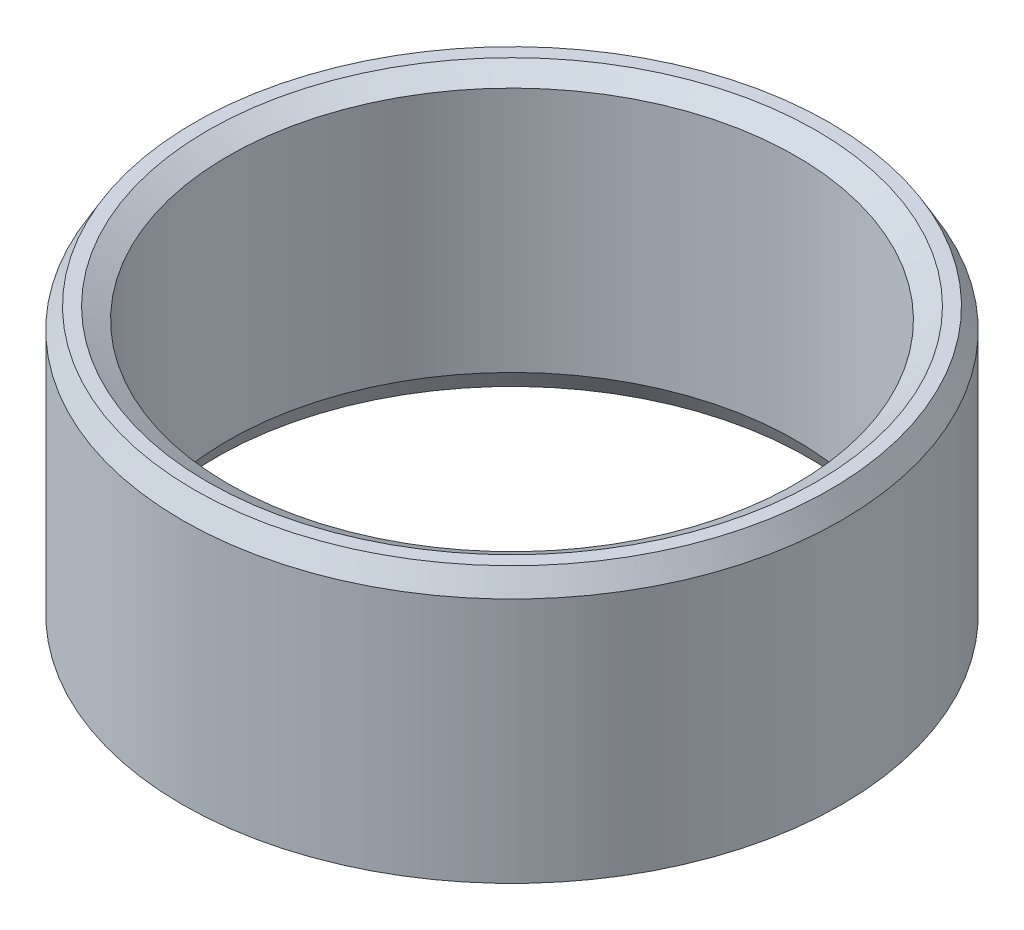
ISO-10303-21;
HEADER;
FILE_DESCRIPTION(('STEP AP214'),'2;1');
FILE_NAME('part.step','',(''),(''),'','','');
FILE_SCHEMA(('AUTOMOTIVE_DESIGN { 1 0 10303 214 1 1 1 1 }'));
ENDSEC;
DATA;
#1=APPLICATION_CONTEXT('core data for automotive mechanical design processes');
#2=APPLICATION_PROTOCOL_DEFINITION('international standard','automotive_design',2000,#1);
#3=PRODUCT_CONTEXT('',#1,'mechanical');
#4=PRODUCT('Part','Part','',(#3));
#5=PRODUCT_RELATED_PRODUCT_CATEGORY('part','',(#4));
#6=PRODUCT_DEFINITION_FORMATION('','',#4);
#7=PRODUCT_DEFINITION_CONTEXT('part definition',#1,'design');
#8=PRODUCT_DEFINITION('design','',#6,#7);
#9=PRODUCT_DEFINITION_SHAPE('','',#8);
#10=(LENGTH_UNIT() NAMED_UNIT(*) SI_UNIT(.MILLI.,.METRE.));
#11=(NAMED_UNIT(*) PLANE_ANGLE_UNIT() SI_UNIT($,.RADIAN.));
#12=(NAMED_UNIT(*) SI_UNIT($,.STERADIAN.) SOLID_ANGLE_UNIT());
#13=UNCERTAINTY_MEASURE_WITH_UNIT(LENGTH_MEASURE(1.E-05),#10,'distance_accuracy_value','');
#14=(GEOMETRIC_REPRESENTATION_CONTEXT(3) GLOBAL_UNCERTAINTY_ASSIGNED_CONTEXT((#13)) GLOBAL_UNIT_ASSIGNED_CONTEXT((#10,
#11,#12)) REPRESENTATION_CONTEXT('',''));
#15=CARTESIAN_POINT('',(0.,0.,0.));
#16=DIRECTION('',(0.,0.,1.));
#17=DIRECTION('',(1.,0.,0.));
#18=AXIS2_PLACEMENT_3D('',#15,#16,#17);
#19=CARTESIAN_POINT('',(0.,46.4747391328106,0.));
#20=DIRECTION('',(0.,-1.,0.));
#21=DIRECTION('',(0.,0.,-1.));
#22=AXIS2_PLACEMENT_3D('',#19,#20,#21);
#23=CYLINDRICAL_SURFACE('',#22,55.);
#24=CARTESIAN_POINT('',(0.,1.97463969113813,0.));
#25=DIRECTION('',(0.,1.,0.));
#26=DIRECTION('',(0.,0.,1.));
#27=AXIS2_PLACEMENT_3D('',#24,#25,#26);
#28=CIRCLE('',#27,55.);
#29=CARTESIAN_POINT('',(0.,1.97463969113813,55.));
#30=VERTEX_POINT('',#29);
#31=EDGE_CURVE('E10',#30,#30,#28,.T.);
#32=ORIENTED_EDGE('',*,*,#31,.T.);
#33=EDGE_LOOP('',(#32));
#34=FACE_BOUND('',#33,.T.);
#35=CARTESIAN_POINT('',(0.,43.0545628611172,0.));
#36=DIRECTION('',(0.,1.,0.));
#37=DIRECTION('',(0.,0.,1.));
#38=AXIS2_PLACEMENT_3D('',#35,#36,#37);
#39=CIRCLE('',#38,55.);
#40=CARTESIAN_POINT('',(0.,43.0545628611172,55.));
#41=VERTEX_POINT('',#40);
#42=EDGE_CURVE('E50',#41,#41,#39,.F.);
#43=ORIENTED_EDGE('',*,*,#42,.T.);
#44=EDGE_LOOP('',(#43));
#45=FACE_BOUND('',#44,.T.);
#46=ADVANCED_FACE('F39',(#34,#45),#23,.T.);
#47=CARTESIAN_POINT('',(0.,46.4747391328106,0.));
#48=DIRECTION('',(0.,1.,0.));
#49=DIRECTION('',(0.,0.,1.));
#50=AXIS2_PLACEMENT_3D('',#47,#48,#49);
#51=PLANE('',#50);
#52=CARTESIAN_POINT('',(0.,46.4747391328106,0.));
#53=DIRECTION('',(0.,1.,0.));
#54=DIRECTION('',(0.,0.,1.));
#55=AXIS2_PLACEMENT_3D('',#52,#53,#54);
#56=CIRCLE('',#55,50.7773806204614);
#57=CARTESIAN_POINT('',(0.,46.4747391328106,50.7773806204614));
#58=VERTEX_POINT('',#57);
#59=EDGE_CURVE('E58',#58,#58,#56,.F.);
#60=ORIENTED_EDGE('',*,*,#59,.T.);
#61=EDGE_LOOP('',(#60));
#62=FACE_BOUND('',#61,.T.);
#63=CARTESIAN_POINT('',(0.,46.4747391328106,0.));
#64=DIRECTION('',(0.,1.,0.));
#65=DIRECTION('',(0.,0.,1.));
#66=AXIS2_PLACEMENT_3D('',#63,#64,#65);
#67=CIRCLE('',#66,53.0253603088618);
#68=CARTESIAN_POINT('',(0.,46.4747391328106,53.0253603088618));
#69=VERTEX_POINT('',#68);
#70=EDGE_CURVE('E61',#69,#69,#67,.T.);
#71=ORIENTED_EDGE('',*,*,#70,.T.);
#72=EDGE_LOOP('',(#71));
#73=FACE_BOUND('',#72,.T.);
#74=ADVANCED_FACE('F88',(#62,#73),#51,.T.);
#75=CARTESIAN_POINT('',(0.,0.,0.));
#76=DIRECTION('',(0.,1.,0.));
#77=DIRECTION('',(0.,0.,1.));
#78=AXIS2_PLACEMENT_3D('',#75,#76,#77);
#79=PLANE('',#78);
#80=CARTESIAN_POINT('',(0.,0.,0.));
#81=DIRECTION('',(0.,1.,0.));
#82=DIRECTION('',(0.,0.,1.));
#83=AXIS2_PLACEMENT_3D('',#80,#81,#82);
#84=CIRCLE('',#83,49.331844039906);
#85=CARTESIAN_POINT('',(0.,0.,49.331844039906));
#86=VERTEX_POINT('',#85);
#87=EDGE_CURVE('E51',#86,#86,#84,.T.);
#88=ORIENTED_EDGE('',*,*,#87,.T.);
#89=EDGE_LOOP('',(#88));
#90=FACE_BOUND('',#89,.T.);
#91=CARTESIAN_POINT('',(0.,0.,0.));
#92=DIRECTION('',(0.,1.,0.));
#93=DIRECTION('',(0.,0.,1.));
#94=AXIS2_PLACEMENT_3D('',#91,#92,#93);
#95=CIRCLE('',#94,51.5798237283066);
#96=CARTESIAN_POINT('',(0.,0.,51.5798237283066));
#97=VERTEX_POINT('',#96);
#98=EDGE_CURVE('E54',#97,#97,#95,.F.);
#99=ORIENTED_EDGE('',*,*,#98,.T.);
#100=EDGE_LOOP('',(#99));
#101=FACE_BOUND('',#100,.T.);
#102=ADVANCED_FACE('F83',(#90,#101),#79,.F.);
#103=CARTESIAN_POINT('',(0.,46.4747391328106,0.));
#104=DIRECTION('',(0.,-1.,0.));
#105=DIRECTION('',(0.,0.,-1.));
#106=AXIS2_PLACEMENT_3D('',#103,#104,#105);
#107=CYLINDRICAL_SURFACE('',#106,47.3572043487679);
#108=CARTESIAN_POINT('',(0.,44.5000994416725,0.));
#109=DIRECTION('',(0.,1.,0.));
#110=DIRECTION('',(0.,0.,1.));
#111=AXIS2_PLACEMENT_3D('',#108,#109,#110);
#112=CIRCLE('',#111,47.3572043487679);
#113=CARTESIAN_POINT('',(0.,44.5000994416725,47.3572043487679));
#114=VERTEX_POINT('',#113);
#115=EDGE_CURVE('E67',#114,#114,#112,.T.);
#116=ORIENTED_EDGE('',*,*,#115,.T.);
#117=EDGE_LOOP('',(#116));
#118=FACE_BOUND('',#117,.T.);
#119=CARTESIAN_POINT('',(0.,3.42017627169341,0.));
#120=DIRECTION('',(0.,1.,0.));
#121=DIRECTION('',(0.,0.,1.));
#122=AXIS2_PLACEMENT_3D('',#119,#120,#121);
#123=CIRCLE('',#122,47.3572043487679);
#124=CARTESIAN_POINT('',(0.,3.42017627169341,47.3572043487679));
#125=VERTEX_POINT('',#124);
#126=EDGE_CURVE('E69',#125,#125,#123,.F.);
#127=ORIENTED_EDGE('',*,*,#126,.T.);
#128=EDGE_LOOP('',(#127));
#129=FACE_BOUND('',#128,.T.);
#130=ADVANCED_FACE('F71',(#118,#129),#107,.F.);
#131=CARTESIAN_POINT('',(0.,44.5000994416725,0.));
#132=DIRECTION('',(0.,1.,0.));
#133=DIRECTION('',(0.,0.,1.));
#134=AXIS2_PLACEMENT_3D('',#131,#132,#133);
#135=CONICAL_SURFACE('',#134,47.3572043487679,1.0471975511966);
#136=ORIENTED_EDGE('',*,*,#59,.F.);
#137=EDGE_LOOP('',(#136));
#138=FACE_BOUND('',#137,.T.);
#139=ORIENTED_EDGE('',*,*,#115,.F.);
#140=EDGE_LOOP('',(#139));
#141=FACE_BOUND('',#140,.T.);
#142=ADVANCED_FACE('F77',(#138,#141),#135,.F.);
#143=CARTESIAN_POINT('',(0.,0.,0.));
#144=DIRECTION('',(0.,-1.,0.));
#145=DIRECTION('',(0.,0.,-1.));
#146=AXIS2_PLACEMENT_3D('',#143,#144,#145);
#147=CONICAL_SURFACE('',#146,49.331844039906,0.523598775598294);
#148=ORIENTED_EDGE('',*,*,#126,.F.);
#149=EDGE_LOOP('',(#148));
#150=FACE_BOUND('',#149,.T.);
#151=ORIENTED_EDGE('',*,*,#87,.F.);
#152=EDGE_LOOP('',(#151));
#153=FACE_BOUND('',#152,.T.);
#154=ADVANCED_FACE('F73',(#150,#153),#147,.F.);
#155=CARTESIAN_POINT('',(0.,1.97463969113813,0.));
#156=DIRECTION('',(0.,1.,0.));
#157=DIRECTION('',(0.,0.,1.));
#158=AXIS2_PLACEMENT_3D('',#155,#156,#157);
#159=CONICAL_SURFACE('',#158,55.,1.0471975511966);
#160=ORIENTED_EDGE('',*,*,#98,.F.);
#161=EDGE_LOOP('',(#160));
#162=FACE_BOUND('',#161,.T.);
#163=ORIENTED_EDGE('',*,*,#31,.F.);
#164=EDGE_LOOP('',(#163));
#165=FACE_BOUND('',#164,.T.);
#166=ADVANCED_FACE('F76',(#162,#165),#159,.T.);
#167=CARTESIAN_POINT('',(0.,46.4747391328106,0.));
#168=DIRECTION('',(0.,-1.,0.));
#169=DIRECTION('',(0.,0.,-1.));
#170=AXIS2_PLACEMENT_3D('',#167,#168,#169);
#171=CONICAL_SURFACE('',#170,53.0253603088618,0.523598775598297);
#172=ORIENTED_EDGE('',*,*,#42,.F.);
#173=EDGE_LOOP('',(#172));
#174=FACE_BOUND('',#173,.T.);
#175=ORIENTED_EDGE('',*,*,#70,.F.);
#176=EDGE_LOOP('',(#175));
#177=FACE_BOUND('',#176,.T.);
#178=ADVANCED_FACE('F45',(#174,#177),#171,.T.);
#179=CLOSED_SHELL('',(#46,#74,#102,#130,#142,#154,#166,#178));
#180=MANIFOLD_SOLID_BREP('B2',#179);
#181=ADVANCED_BREP_SHAPE_REPRESENTATION('',(#18,#180),#14);
#182=SHAPE_DEFINITION_REPRESENTATION(#9,#181);
ENDSEC;
END-ISO-10303-21;
